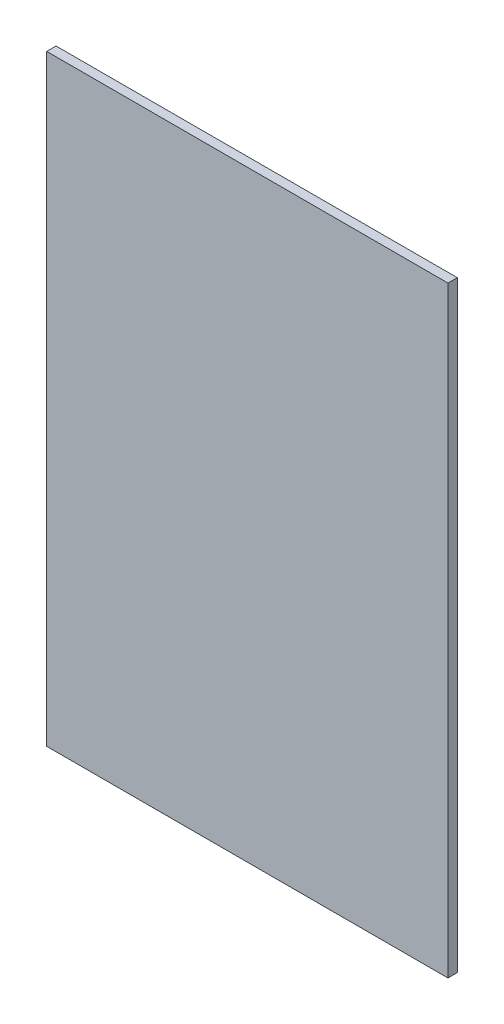
ISO-10303-21;
HEADER;
FILE_DESCRIPTION(('STEP AP214'),'2;1');
FILE_NAME('part.step','',(''),(''),'','','');
FILE_SCHEMA(('AUTOMOTIVE_DESIGN { 1 0 10303 214 1 1 1 1 }'));
ENDSEC;
DATA;
#1=APPLICATION_CONTEXT('core data for automotive mechanical design processes');
#2=APPLICATION_PROTOCOL_DEFINITION('international standard','automotive_design',2000,#1);
#3=PRODUCT_CONTEXT('',#1,'mechanical');
#4=PRODUCT('Part','Part','',(#3));
#5=PRODUCT_RELATED_PRODUCT_CATEGORY('part','',(#4));
#6=PRODUCT_DEFINITION_FORMATION('','',#4);
#7=PRODUCT_DEFINITION_CONTEXT('part definition',#1,'design');
#8=PRODUCT_DEFINITION('design','',#6,#7);
#9=PRODUCT_DEFINITION_SHAPE('','',#8);
#10=(LENGTH_UNIT() NAMED_UNIT(*) SI_UNIT(.MILLI.,.METRE.));
#11=(NAMED_UNIT(*) PLANE_ANGLE_UNIT() SI_UNIT($,.RADIAN.));
#12=(NAMED_UNIT(*) SI_UNIT($,.STERADIAN.) SOLID_ANGLE_UNIT());
#13=UNCERTAINTY_MEASURE_WITH_UNIT(LENGTH_MEASURE(1.E-05),#10,'distance_accuracy_value','');
#14=(GEOMETRIC_REPRESENTATION_CONTEXT(3) GLOBAL_UNCERTAINTY_ASSIGNED_CONTEXT((#13)) GLOBAL_UNIT_ASSIGNED_CONTEXT((#10,
#11,#12)) REPRESENTATION_CONTEXT('',''));
#15=CARTESIAN_POINT('',(0.,0.,0.));
#16=DIRECTION('',(0.,0.,1.));
#17=DIRECTION('',(1.,0.,0.));
#18=AXIS2_PLACEMENT_3D('',#15,#16,#17);
#19=CARTESIAN_POINT('',(0.,0.,2.3622));
#20=DIRECTION('',(1.,0.,0.));
#21=DIRECTION('',(0.,1.,0.));
#22=AXIS2_PLACEMENT_3D('',#19,#20,#21);
#23=PLANE('',#22);
#24=DIRECTION('',(0.,-1.,0.));
#25=VECTOR('',#24,1.);
#26=CARTESIAN_POINT('',(0.,0.,0.));
#27=LINE('',#26,#25);
#28=CARTESIAN_POINT('',(0.,152.4,0.));
#29=VERTEX_POINT('',#28);
#30=CARTESIAN_POINT('',(0.,0.,0.));
#31=VERTEX_POINT('',#30);
#32=EDGE_CURVE('E98',#29,#31,#27,.T.);
#33=ORIENTED_EDGE('',*,*,#32,.T.);
#34=DIRECTION('',(0.,0.,-1.));
#35=VECTOR('',#34,1.);
#36=CARTESIAN_POINT('',(0.,0.,2.3622));
#37=LINE('',#36,#35);
#38=CARTESIAN_POINT('',(0.,0.,2.3622));
#39=VERTEX_POINT('',#38);
#40=EDGE_CURVE('E11',#39,#31,#37,.T.);
#41=ORIENTED_EDGE('',*,*,#40,.F.);
#42=DIRECTION('',(0.,-1.,0.));
#43=VECTOR('',#42,1.);
#44=CARTESIAN_POINT('',(0.,0.,2.3622));
#45=LINE('',#44,#43);
#46=CARTESIAN_POINT('',(0.,152.4,2.3622));
#47=VERTEX_POINT('',#46);
#48=EDGE_CURVE('E86',#47,#39,#45,.T.);
#49=ORIENTED_EDGE('',*,*,#48,.F.);
#50=DIRECTION('',(0.,0.,-1.));
#51=VECTOR('',#50,1.);
#52=CARTESIAN_POINT('',(0.,152.4,2.3622));
#53=LINE('',#52,#51);
#54=EDGE_CURVE('E94',#47,#29,#53,.T.);
#55=ORIENTED_EDGE('',*,*,#54,.T.);
#56=EDGE_LOOP('',(#33,#41,#49,#55));
#57=FACE_BOUND('',#56,.T.);
#58=ADVANCED_FACE('F35',(#57),#23,.F.);
#59=CARTESIAN_POINT('',(0.,0.,2.3622));
#60=DIRECTION('',(0.,1.,0.));
#61=DIRECTION('',(0.,0.,1.));
#62=AXIS2_PLACEMENT_3D('',#59,#60,#61);
#63=PLANE('',#62);
#64=DIRECTION('',(1.,0.,0.));
#65=VECTOR('',#64,1.);
#66=CARTESIAN_POINT('',(0.,0.,0.));
#67=LINE('',#66,#65);
#68=CARTESIAN_POINT('',(101.6,0.,0.));
#69=VERTEX_POINT('',#68);
#70=EDGE_CURVE('E90',#31,#69,#67,.T.);
#71=ORIENTED_EDGE('',*,*,#70,.T.);
#72=DIRECTION('',(0.,0.,-1.));
#73=VECTOR('',#72,1.);
#74=CARTESIAN_POINT('',(101.6,0.,2.3622));
#75=LINE('',#74,#73);
#76=CARTESIAN_POINT('',(101.6,0.,2.3622));
#77=VERTEX_POINT('',#76);
#78=EDGE_CURVE('E43',#77,#69,#75,.T.);
#79=ORIENTED_EDGE('',*,*,#78,.F.);
#80=DIRECTION('',(1.,0.,0.));
#81=VECTOR('',#80,1.);
#82=CARTESIAN_POINT('',(0.,0.,2.3622));
#83=LINE('',#82,#81);
#84=EDGE_CURVE('E81',#39,#77,#83,.T.);
#85=ORIENTED_EDGE('',*,*,#84,.F.);
#86=ORIENTED_EDGE('',*,*,#40,.T.);
#87=EDGE_LOOP('',(#71,#79,#85,#86));
#88=FACE_BOUND('',#87,.T.);
#89=ADVANCED_FACE('F89',(#88),#63,.F.);
#90=CARTESIAN_POINT('',(101.6,0.,2.3622));
#91=DIRECTION('',(-1.,0.,0.));
#92=DIRECTION('',(0.,-1.,0.));
#93=AXIS2_PLACEMENT_3D('',#90,#91,#92);
#94=PLANE('',#93);
#95=DIRECTION('',(0.,1.,0.));
#96=VECTOR('',#95,1.);
#97=CARTESIAN_POINT('',(101.6,0.,0.));
#98=LINE('',#97,#96);
#99=CARTESIAN_POINT('',(101.6,152.4,0.));
#100=VERTEX_POINT('',#99);
#101=EDGE_CURVE('E68',#69,#100,#98,.T.);
#102=ORIENTED_EDGE('',*,*,#101,.T.);
#103=DIRECTION('',(0.,0.,-1.));
#104=VECTOR('',#103,1.);
#105=CARTESIAN_POINT('',(101.6,152.4,2.3622));
#106=LINE('',#105,#104);
#107=CARTESIAN_POINT('',(101.6,152.4,2.3622));
#108=VERTEX_POINT('',#107);
#109=EDGE_CURVE('E91',#108,#100,#106,.T.);
#110=ORIENTED_EDGE('',*,*,#109,.F.);
#111=DIRECTION('',(0.,1.,0.));
#112=VECTOR('',#111,1.);
#113=CARTESIAN_POINT('',(101.6,0.,2.3622));
#114=LINE('',#113,#112);
#115=EDGE_CURVE('E84',#77,#108,#114,.T.);
#116=ORIENTED_EDGE('',*,*,#115,.F.);
#117=ORIENTED_EDGE('',*,*,#78,.T.);
#118=EDGE_LOOP('',(#102,#110,#116,#117));
#119=FACE_BOUND('',#118,.T.);
#120=ADVANCED_FACE('F92',(#119),#94,.F.);
#121=CARTESIAN_POINT('',(0.,152.4,2.3622));
#122=DIRECTION('',(0.,-1.,0.));
#123=DIRECTION('',(0.,0.,-1.));
#124=AXIS2_PLACEMENT_3D('',#121,#122,#123);
#125=PLANE('',#124);
#126=DIRECTION('',(-1.,0.,0.));
#127=VECTOR('',#126,1.);
#128=CARTESIAN_POINT('',(0.,152.4,0.));
#129=LINE('',#128,#127);
#130=EDGE_CURVE('E74',#100,#29,#129,.T.);
#131=ORIENTED_EDGE('',*,*,#130,.T.);
#132=ORIENTED_EDGE('',*,*,#54,.F.);
#133=DIRECTION('',(-1.,0.,0.));
#134=VECTOR('',#133,1.);
#135=CARTESIAN_POINT('',(0.,152.4,2.3622));
#136=LINE('',#135,#134);
#137=EDGE_CURVE('E51',#108,#47,#136,.T.);
#138=ORIENTED_EDGE('',*,*,#137,.F.);
#139=ORIENTED_EDGE('',*,*,#109,.T.);
#140=EDGE_LOOP('',(#131,#132,#138,#139));
#141=FACE_BOUND('',#140,.T.);
#142=ADVANCED_FACE('F105',(#141),#125,.F.);
#143=CARTESIAN_POINT('',(0.,0.,2.3622));
#144=DIRECTION('',(0.,0.,-1.));
#145=DIRECTION('',(-1.,0.,0.));
#146=AXIS2_PLACEMENT_3D('',#143,#144,#145);
#147=PLANE('',#146);
#148=ORIENTED_EDGE('',*,*,#48,.T.);
#149=ORIENTED_EDGE('',*,*,#84,.T.);
#150=ORIENTED_EDGE('',*,*,#115,.T.);
#151=ORIENTED_EDGE('',*,*,#137,.T.);
#152=EDGE_LOOP('',(#148,#149,#150,#151));
#153=FACE_BOUND('',#152,.T.);
#154=ADVANCED_FACE('F82',(#153),#147,.F.);
#155=CARTESIAN_POINT('',(0.,0.,0.));
#156=DIRECTION('',(0.,0.,-1.));
#157=DIRECTION('',(-1.,0.,0.));
#158=AXIS2_PLACEMENT_3D('',#155,#156,#157);
#159=PLANE('',#158);
#160=ORIENTED_EDGE('',*,*,#32,.F.);
#161=ORIENTED_EDGE('',*,*,#130,.F.);
#162=ORIENTED_EDGE('',*,*,#101,.F.);
#163=ORIENTED_EDGE('',*,*,#70,.F.);
#164=EDGE_LOOP('',(#160,#161,#162,#163));
#165=FACE_BOUND('',#164,.T.);
#166=ADVANCED_FACE('F108',(#165),#159,.T.);
#167=CLOSED_SHELL('',(#58,#89,#120,#142,#154,#166));
#168=MANIFOLD_SOLID_BREP('B2',#167);
#169=ADVANCED_BREP_SHAPE_REPRESENTATION('',(#18,#168),#14);
#170=SHAPE_DEFINITION_REPRESENTATION(#9,#169);
ENDSEC;
END-ISO-10303-21;
